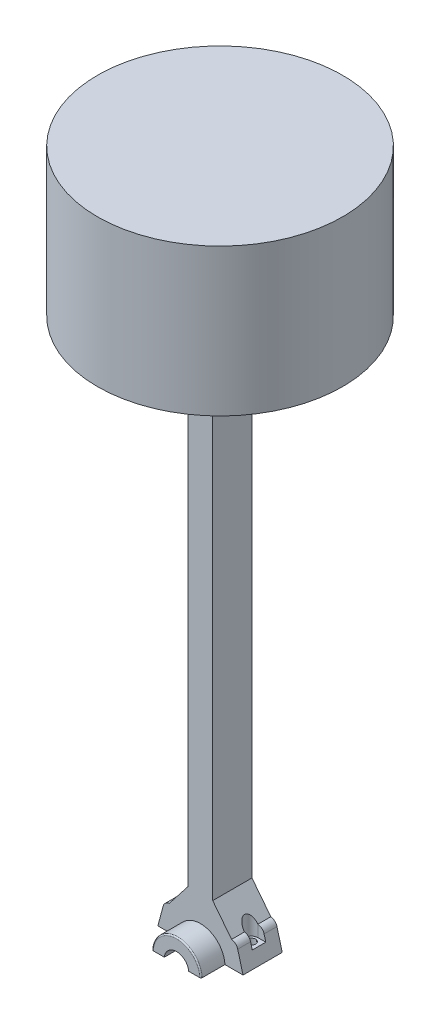
ISO-10303-21;
HEADER;
FILE_DESCRIPTION(('STEP AP214'),'2;1');
FILE_NAME('part.step','',(''),(''),'','','');
FILE_SCHEMA(('AUTOMOTIVE_DESIGN { 1 0 10303 214 1 1 1 1 }'));
ENDSEC;
DATA;
#1=APPLICATION_CONTEXT('core data for automotive mechanical design processes');
#2=APPLICATION_PROTOCOL_DEFINITION('international standard','automotive_design',2000,#1);
#3=PRODUCT_CONTEXT('',#1,'mechanical');
#4=PRODUCT('Part','Part','',(#3));
#5=PRODUCT_RELATED_PRODUCT_CATEGORY('part','',(#4));
#6=PRODUCT_DEFINITION_FORMATION('','',#4);
#7=PRODUCT_DEFINITION_CONTEXT('part definition',#1,'design');
#8=PRODUCT_DEFINITION('design','',#6,#7);
#9=PRODUCT_DEFINITION_SHAPE('','',#8);
#10=(LENGTH_UNIT() NAMED_UNIT(*) SI_UNIT(.MILLI.,.METRE.));
#11=(NAMED_UNIT(*) PLANE_ANGLE_UNIT() SI_UNIT($,.RADIAN.));
#12=(NAMED_UNIT(*) SI_UNIT($,.STERADIAN.) SOLID_ANGLE_UNIT());
#13=UNCERTAINTY_MEASURE_WITH_UNIT(LENGTH_MEASURE(1.E-05),#10,'distance_accuracy_value','');
#14=(GEOMETRIC_REPRESENTATION_CONTEXT(3) GLOBAL_UNCERTAINTY_ASSIGNED_CONTEXT((#13)) GLOBAL_UNIT_ASSIGNED_CONTEXT((#10,
#11,#12)) REPRESENTATION_CONTEXT('',''));
#15=CARTESIAN_POINT('',(0.,0.,0.));
#16=DIRECTION('',(0.,0.,1.));
#17=DIRECTION('',(1.,0.,0.));
#18=AXIS2_PLACEMENT_3D('',#15,#16,#17);
#19=CARTESIAN_POINT('',(-35.,0.,30.5));
#20=DIRECTION('',(-0.965925826289067,0.258819045102525,0.));
#21=DIRECTION('',(-0.258819045102525,-0.965925826289067,0.));
#22=AXIS2_PLACEMENT_3D('',#19,#20,#21);
#23=PLANE('',#22);
#24=DIRECTION('',(0.,0.,-1.));
#25=VECTOR('',#24,1.);
#26=CARTESIAN_POINT('',(-34.7320508075689,1.,30.5));
#27=LINE('',#26,#25);
#28=CARTESIAN_POINT('',(-34.7320508075689,1.,30.5));
#29=VERTEX_POINT('',#28);
#30=CARTESIAN_POINT('',(-34.7320508075689,1.,-1.5));
#31=VERTEX_POINT('',#30);
#32=EDGE_CURVE('E276',#29,#31,#27,.T.);
#33=ORIENTED_EDGE('',*,*,#32,.F.);
#34=DIRECTION('',(0.258819045102525,0.965925826289067,0.));
#35=VECTOR('',#34,1.);
#36=CARTESIAN_POINT('',(-35.,0.,30.5));
#37=LINE('',#36,#35);
#38=CARTESIAN_POINT('',(-30.4057040927294,17.1461457509392,30.5));
#39=VERTEX_POINT('',#38);
#40=EDGE_CURVE('E398',#29,#39,#37,.T.);
#41=ORIENTED_EDGE('',*,*,#40,.T.);
#42=DIRECTION('',(0.,0.,-1.));
#43=VECTOR('',#42,1.);
#44=CARTESIAN_POINT('',(-30.4057040927294,17.1461457509392,30.5));
#45=LINE('',#44,#43);
#46=CARTESIAN_POINT('',(-30.4057040927294,17.1461457509392,20.));
#47=VERTEX_POINT('',#46);
#48=EDGE_CURVE('E408',#39,#47,#45,.T.);
#49=ORIENTED_EDGE('',*,*,#48,.T.);
#50=DIRECTION('',(0.258819045102525,0.965925826289067,0.));
#51=VECTOR('',#50,1.);
#52=CARTESIAN_POINT('',(-28.113370667976,25.7012505600074,20.));
#53=LINE('',#52,#51);
#54=CARTESIAN_POINT('',(-31.7846096908265,12.,20.));
#55=VERTEX_POINT('',#54);
#56=EDGE_CURVE('E287',#55,#47,#53,.T.);
#57=ORIENTED_EDGE('',*,*,#56,.F.);
#58=DIRECTION('',(0.,0.,-1.));
#59=VECTOR('',#58,1.);
#60=CARTESIAN_POINT('',(-31.7846096908265,12.,14.5));
#61=LINE('',#60,#59);
#62=CARTESIAN_POINT('',(-31.7846096908265,12.,9.));
#63=VERTEX_POINT('',#62);
#64=EDGE_CURVE('E332',#55,#63,#61,.T.);
#65=ORIENTED_EDGE('',*,*,#64,.T.);
#66=DIRECTION('',(-0.258819045102525,-0.965925826289067,0.));
#67=VECTOR('',#66,1.);
#68=CARTESIAN_POINT('',(-28.113370667976,25.7012505600074,9.));
#69=LINE('',#68,#67);
#70=CARTESIAN_POINT('',(-30.4057040927294,17.1461457509392,8.99999999999999));
#71=VERTEX_POINT('',#70);
#72=EDGE_CURVE('E289',#71,#63,#69,.T.);
#73=ORIENTED_EDGE('',*,*,#72,.F.);
#74=CARTESIAN_POINT('',(-30.4057040927294,17.1461457509392,-1.5));
#75=VERTEX_POINT('',#74);
#76=EDGE_CURVE('E407',#71,#75,#45,.T.);
#77=ORIENTED_EDGE('',*,*,#76,.T.);
#78=DIRECTION('',(0.258819045102525,0.965925826289067,0.));
#79=VECTOR('',#78,1.);
#80=CARTESIAN_POINT('',(-35.,0.,-1.5));
#81=LINE('',#80,#79);
#82=EDGE_CURVE('E399',#31,#75,#81,.T.);
#83=ORIENTED_EDGE('',*,*,#82,.F.);
#84=EDGE_LOOP('',(#33,#41,#49,#57,#65,#73,#77,#83));
#85=FACE_BOUND('',#84,.T.);
#86=ADVANCED_FACE('F39',(#85),#23,.T.);
#87=CARTESIAN_POINT('',(-24.610149134995,15.5932314803241,30.5));
#88=DIRECTION('',(0.,0.,-1.));
#89=DIRECTION('',(-1.,0.,0.));
#90=AXIS2_PLACEMENT_3D('',#87,#88,#89);
#91=CYLINDRICAL_SURFACE('',#90,6.);
#92=CARTESIAN_POINT('',(-24.610149134995,15.5932314803241,9.));
#93=DIRECTION('',(0.,0.,1.));
#94=DIRECTION('',(1.,0.,0.));
#95=AXIS2_PLACEMENT_3D('',#92,#93,#94);
#96=CIRCLE('',#95,6.);
#97=CARTESIAN_POINT('',(-25.5,21.526878372249,9.));
#98=VERTEX_POINT('',#97);
#99=EDGE_CURVE('E300',#98,#71,#96,.T.);
#100=ORIENTED_EDGE('',*,*,#99,.F.);
#101=CARTESIAN_POINT('',(-25.4197517185428,21.5383592044956,9.00058546631342));
#102=CARTESIAN_POINT('',(-25.4331386603451,21.5365361855752,9.00039021776701));
#103=CARTESIAN_POINT('',(-25.4465194880343,21.5346679400944,9.00024380463436));
#104=CARTESIAN_POINT('',(-25.4732689151867,21.5308409960122,9.00004864919655));
#105=CARTESIAN_POINT('',(-25.4866375146498,21.5288822974107,8.9999999068914));
#106=CARTESIAN_POINT('',(-25.5,21.526878372249,9.));
#107=B_SPLINE_CURVE_WITH_KNOTS('',3,(#101,#102,#103,#104,#105,#106),.UNSPECIFIED.,.F.,.F.,(4,2,
4),(0.,0.0405342441482808,0.0810684882965614),.UNSPECIFIED.);
#108=CARTESIAN_POINT('',(-25.4197517185428,21.5383592044956,9.00058546631355));
#109=VERTEX_POINT('',#108);
#110=EDGE_CURVE('E314',#109,#98,#107,.T.);
#111=ORIENTED_EDGE('',*,*,#110,.F.);
#112=DIRECTION('',(0.,0.,-1.));
#113=VECTOR('',#112,1.);
#114=CARTESIAN_POINT('',(-25.4197517185428,21.5383592044956,30.5));
#115=LINE('',#114,#113);
#116=CARTESIAN_POINT('',(-25.4197517185428,21.5383592044956,-1.5));
#117=VERTEX_POINT('',#116);
#118=EDGE_CURVE('E416',#117,#109,#115,.F.);
#119=ORIENTED_EDGE('',*,*,#118,.F.);
#120=CARTESIAN_POINT('',(-24.610149134995,15.5932314803241,-1.5));
#121=DIRECTION('',(0.,0.,1.));
#122=DIRECTION('',(1.,0.,0.));
#123=AXIS2_PLACEMENT_3D('',#120,#121,#122);
#124=CIRCLE('',#123,6.);
#125=EDGE_CURVE('E413',#75,#117,#124,.F.);
#126=ORIENTED_EDGE('',*,*,#125,.F.);
#127=ORIENTED_EDGE('',*,*,#76,.F.);
#128=EDGE_LOOP('',(#100,#111,#119,#126,#127));
#129=FACE_BOUND('',#128,.T.);
#130=ADVANCED_FACE('F473',(#129),#91,.T.);
#131=CARTESIAN_POINT('',(-25.4197517185428,21.5383592044956,19.9994145336867));
#132=VERTEX_POINT('',#131);
#133=CARTESIAN_POINT('',(-25.4197517185428,21.5383592044956,30.5));
#134=VERTEX_POINT('',#133);
#135=EDGE_CURVE('E415',#132,#134,#115,.F.);
#136=ORIENTED_EDGE('',*,*,#135,.F.);
#137=CARTESIAN_POINT('',(-25.5,21.526878372249,20.));
#138=CARTESIAN_POINT('',(-25.4866375146498,21.5288822974107,20.0000000931086));
#139=CARTESIAN_POINT('',(-25.4732689151867,21.5308409960122,19.9999513508034));
#140=CARTESIAN_POINT('',(-25.4465194880343,21.5346679400944,19.9997561953656));
#141=CARTESIAN_POINT('',(-25.4331386603451,21.5365361855752,19.999609782233));
#142=CARTESIAN_POINT('',(-25.4197517185428,21.5383592044956,19.9994145336866));
#143=B_SPLINE_CURVE_WITH_KNOTS('',3,(#137,#138,#139,#140,#141,#142),.UNSPECIFIED.,.F.,.F.,(4,2,
4),(0.,0.0405342441482806,0.0810684882965614),.UNSPECIFIED.);
#144=CARTESIAN_POINT('',(-25.5,21.526878372249,20.));
#145=VERTEX_POINT('',#144);
#146=EDGE_CURVE('E291',#145,#132,#143,.T.);
#147=ORIENTED_EDGE('',*,*,#146,.F.);
#148=CARTESIAN_POINT('',(-24.610149134995,15.5932314803241,20.));
#149=DIRECTION('',(0.,0.,-1.));
#150=DIRECTION('',(-1.,0.,0.));
#151=AXIS2_PLACEMENT_3D('',#148,#149,#150);
#152=CIRCLE('',#151,6.);
#153=EDGE_CURVE('E336',#47,#145,#152,.T.);
#154=ORIENTED_EDGE('',*,*,#153,.F.);
#155=ORIENTED_EDGE('',*,*,#48,.F.);
#156=CARTESIAN_POINT('',(-24.610149134995,15.5932314803241,30.5));
#157=DIRECTION('',(0.,0.,1.));
#158=DIRECTION('',(1.,0.,0.));
#159=AXIS2_PLACEMENT_3D('',#156,#157,#158);
#160=CIRCLE('',#159,6.);
#161=EDGE_CURVE('E422',#134,#39,#160,.T.);
#162=ORIENTED_EDGE('',*,*,#161,.F.);
#163=EDGE_LOOP('',(#136,#147,#154,#155,#162));
#164=FACE_BOUND('',#163,.T.);
#165=ADVANCED_FACE('F479',(#164),#91,.T.);
#166=CARTESIAN_POINT('',(24.610149134995,15.5932314803241,30.5));
#167=DIRECTION('',(0.,0.,-1.));
#168=DIRECTION('',(-1.,0.,0.));
#169=AXIS2_PLACEMENT_3D('',#166,#167,#168);
#170=CYLINDRICAL_SURFACE('',#169,6.);
#171=CARTESIAN_POINT('',(24.610149134995,15.5932314803241,20.));
#172=DIRECTION('',(0.,0.,1.));
#173=DIRECTION('',(1.,0.,0.));
#174=AXIS2_PLACEMENT_3D('',#171,#172,#173);
#175=CIRCLE('',#174,6.);
#176=CARTESIAN_POINT('',(30.4057040927294,17.1461457509392,20.));
#177=VERTEX_POINT('',#176);
#178=CARTESIAN_POINT('',(25.5,21.526878372249,20.));
#179=VERTEX_POINT('',#178);
#180=EDGE_CURVE('E356',#177,#179,#175,.T.);
#181=ORIENTED_EDGE('',*,*,#180,.T.);
#182=CARTESIAN_POINT('',(25.5,21.526878372249,20.));
#183=CARTESIAN_POINT('',(25.4866375146499,21.5288822974107,20.0000000931086));
#184=CARTESIAN_POINT('',(25.4732689151867,21.5308409960122,19.9999513508034));
#185=CARTESIAN_POINT('',(25.4465194880343,21.5346679400944,19.9997561953656));
#186=CARTESIAN_POINT('',(25.4331386603451,21.5365361855752,19.999609782233));
#187=CARTESIAN_POINT('',(25.4197517185428,21.5383592044956,19.9994145336866));
#188=B_SPLINE_CURVE_WITH_KNOTS('',3,(#182,#183,#184,#185,#186,#187),.UNSPECIFIED.,.F.,.F.,(4,2,
4),(0.,0.0405342441482771,0.081068488296558),.UNSPECIFIED.);
#189=CARTESIAN_POINT('',(25.4197517185428,21.5383592044956,19.9994145336866));
#190=VERTEX_POINT('',#189);
#191=EDGE_CURVE('E368',#179,#190,#188,.T.);
#192=ORIENTED_EDGE('',*,*,#191,.T.);
#193=DIRECTION('',(0.,0.,-1.));
#194=VECTOR('',#193,1.);
#195=CARTESIAN_POINT('',(25.4197517185428,21.5383592044956,30.5));
#196=LINE('',#195,#194);
#197=CARTESIAN_POINT('',(25.4197517185429,21.5383592044956,30.5));
#198=VERTEX_POINT('',#197);
#199=EDGE_CURVE('E426',#198,#190,#196,.T.);
#200=ORIENTED_EDGE('',*,*,#199,.F.);
#201=CARTESIAN_POINT('',(24.610149134995,15.5932314803241,30.5));
#202=DIRECTION('',(0.,0.,1.));
#203=DIRECTION('',(1.,0.,0.));
#204=AXIS2_PLACEMENT_3D('',#201,#202,#203);
#205=CIRCLE('',#204,6.);
#206=CARTESIAN_POINT('',(30.4057040927294,17.1461457509392,30.5));
#207=VERTEX_POINT('',#206);
#208=EDGE_CURVE('E419',#207,#198,#205,.T.);
#209=ORIENTED_EDGE('',*,*,#208,.F.);
#210=DIRECTION('',(0.,0.,-1.));
#211=VECTOR('',#210,1.);
#212=CARTESIAN_POINT('',(30.4057040927294,17.1461457509392,30.5));
#213=LINE('',#212,#211);
#214=EDGE_CURVE('E429',#177,#207,#213,.F.);
#215=ORIENTED_EDGE('',*,*,#214,.F.);
#216=EDGE_LOOP('',(#181,#192,#200,#209,#215));
#217=FACE_BOUND('',#216,.T.);
#218=ADVANCED_FACE('F496',(#217),#170,.T.);
#219=CARTESIAN_POINT('',(0.,0.,50.));
#220=DIRECTION('',(0.,0.,-1.));
#221=DIRECTION('',(-1.,0.,0.));
#222=AXIS2_PLACEMENT_3D('',#219,#220,#221);
#223=CYLINDRICAL_SURFACE('',#222,20.);
#224=DIRECTION('',(0.,0.,-1.));
#225=VECTOR('',#224,1.);
#226=CARTESIAN_POINT('',(-19.9749843554382,1.,50.));
#227=LINE('',#226,#225);
#228=CARTESIAN_POINT('',(-19.9749843554382,1.,30.5));
#229=VERTEX_POINT('',#228);
#230=CARTESIAN_POINT('',(-19.9749843554382,1.,49.));
#231=VERTEX_POINT('',#230);
#232=EDGE_CURVE('E274',#229,#231,#227,.F.);
#233=ORIENTED_EDGE('',*,*,#232,.T.);
#234=CARTESIAN_POINT('',(0.,0.,49.));
#235=DIRECTION('',(0.,0.,1.));
#236=DIRECTION('',(1.,0.,0.));
#237=AXIS2_PLACEMENT_3D('',#234,#235,#236);
#238=CIRCLE('',#237,20.);
#239=CARTESIAN_POINT('',(19.9749843554382,1.,49.));
#240=VERTEX_POINT('',#239);
#241=EDGE_CURVE('E11',#231,#240,#238,.F.);
#242=ORIENTED_EDGE('',*,*,#241,.T.);
#243=DIRECTION('',(0.,0.,-1.));
#244=VECTOR('',#243,1.);
#245=CARTESIAN_POINT('',(19.9749843554382,1.,50.));
#246=LINE('',#245,#244);
#247=CARTESIAN_POINT('',(19.9749843554382,1.,30.5));
#248=VERTEX_POINT('',#247);
#249=EDGE_CURVE('E271',#240,#248,#246,.T.);
#250=ORIENTED_EDGE('',*,*,#249,.T.);
#251=CARTESIAN_POINT('',(0.,0.,30.5));
#252=DIRECTION('',(0.,0.,1.));
#253=DIRECTION('',(1.,0.,0.));
#254=AXIS2_PLACEMENT_3D('',#251,#252,#253);
#255=CIRCLE('',#254,20.);
#256=EDGE_CURVE('E401',#248,#229,#255,.T.);
#257=ORIENTED_EDGE('',*,*,#256,.T.);
#258=EDGE_LOOP('',(#233,#242,#250,#257));
#259=FACE_BOUND('',#258,.T.);
#260=ADVANCED_FACE('F493',(#259),#223,.T.);
#261=CARTESIAN_POINT('',(0.,0.,50.));
#262=DIRECTION('',(0.,0.,1.));
#263=DIRECTION('',(1.,0.,0.));
#264=AXIS2_PLACEMENT_3D('',#261,#262,#263);
#265=PLANE('',#264);
#266=DIRECTION('',(-1.,0.,0.));
#267=VECTOR('',#266,1.);
#268=CARTESIAN_POINT('',(-36.,1.,50.));
#269=LINE('',#268,#267);
#270=CARTESIAN_POINT('',(18.9736659610103,1.,50.));
#271=VERTEX_POINT('',#270);
#272=CARTESIAN_POINT('',(9.9498743710662,1.,50.));
#273=VERTEX_POINT('',#272);
#274=EDGE_CURVE('E257',#271,#273,#269,.T.);
#275=ORIENTED_EDGE('',*,*,#274,.F.);
#276=CARTESIAN_POINT('',(0.,0.,50.));
#277=DIRECTION('',(0.,0.,1.));
#278=DIRECTION('',(1.,0.,0.));
#279=AXIS2_PLACEMENT_3D('',#276,#277,#278);
#280=CIRCLE('',#279,19.);
#281=CARTESIAN_POINT('',(-18.9736659610103,1.,50.));
#282=VERTEX_POINT('',#281);
#283=EDGE_CURVE('E443',#271,#282,#280,.T.);
#284=ORIENTED_EDGE('',*,*,#283,.T.);
#285=CARTESIAN_POINT('',(-9.9498743710662,1.,50.));
#286=VERTEX_POINT('',#285);
#287=EDGE_CURVE('E238',#286,#282,#269,.T.);
#288=ORIENTED_EDGE('',*,*,#287,.F.);
#289=CARTESIAN_POINT('',(0.,0.,50.));
#290=DIRECTION('',(0.,0.,1.));
#291=DIRECTION('',(1.,0.,0.));
#292=AXIS2_PLACEMENT_3D('',#289,#290,#291);
#293=CIRCLE('',#292,10.);
#294=EDGE_CURVE('E278',#273,#286,#293,.T.);
#295=ORIENTED_EDGE('',*,*,#294,.F.);
#296=EDGE_LOOP('',(#275,#284,#288,#295));
#297=FACE_BOUND('',#296,.T.);
#298=ADVANCED_FACE('F490',(#297),#265,.T.);
#299=CARTESIAN_POINT('',(27.304937598009,28.718363851643,30.5));
#300=DIRECTION('',(0.,0.,1.));
#301=DIRECTION('',(1.,0.,0.));
#302=AXIS2_PLACEMENT_3D('',#299,#300,#301);
#303=PLANE('',#302);
#304=ORIENTED_EDGE('',*,*,#208,.T.);
#305=DIRECTION('',(0.615661475325659,-0.788010753606721,0.));
#306=VECTOR('',#305,1.);
#307=CARTESIAN_POINT('',(25.4197517185429,21.5383592044956,30.5));
#308=LINE('',#307,#306);
#309=CARTESIAN_POINT('',(10.0282148354014,41.2386280446636,30.5));
#310=VERTEX_POINT('',#309);
#311=EDGE_CURVE('E236',#310,#198,#308,.T.);
#312=ORIENTED_EDGE('',*,*,#311,.F.);
#313=DIRECTION('',(0.,-1.,0.));
#314=VECTOR('',#313,1.);
#315=CARTESIAN_POINT('',(10.0282148354014,41.2386280446636,30.5));
#316=LINE('',#315,#314);
#317=CARTESIAN_POINT('',(10.0282148354014,441.238628044664,30.5));
#318=VERTEX_POINT('',#317);
#319=EDGE_CURVE('E240',#318,#310,#316,.T.);
#320=ORIENTED_EDGE('',*,*,#319,.F.);
#321=DIRECTION('',(1.,0.,0.));
#322=VECTOR('',#321,1.);
#323=CARTESIAN_POINT('',(10.0282148354014,441.238628044664,30.5));
#324=LINE('',#323,#322);
#325=CARTESIAN_POINT('',(-10.0282148354013,441.238628044664,30.5));
#326=VERTEX_POINT('',#325);
#327=EDGE_CURVE('E225',#326,#318,#324,.T.);
#328=ORIENTED_EDGE('',*,*,#327,.F.);
#329=DIRECTION('',(0.,1.,0.));
#330=VECTOR('',#329,1.);
#331=CARTESIAN_POINT('',(-10.0282148354014,41.2386280446636,30.5));
#332=LINE('',#331,#330);
#333=CARTESIAN_POINT('',(-10.0282148354014,41.2386280446636,30.5));
#334=VERTEX_POINT('',#333);
#335=EDGE_CURVE('E224',#334,#326,#332,.T.);
#336=ORIENTED_EDGE('',*,*,#335,.F.);
#337=DIRECTION('',(0.61566147532566,0.788010753606721,0.));
#338=VECTOR('',#337,1.);
#339=CARTESIAN_POINT('',(-25.4197517185428,21.5383592044956,30.5));
#340=LINE('',#339,#338);
#341=EDGE_CURVE('E246',#134,#334,#340,.T.);
#342=ORIENTED_EDGE('',*,*,#341,.F.);
#343=ORIENTED_EDGE('',*,*,#161,.T.);
#344=ORIENTED_EDGE('',*,*,#40,.F.);
#345=DIRECTION('',(-1.,0.,0.));
#346=VECTOR('',#345,1.);
#347=CARTESIAN_POINT('',(27.304937598009,1.,30.5));
#348=LINE('',#347,#346);
#349=EDGE_CURVE('E272',#229,#29,#348,.T.);
#350=ORIENTED_EDGE('',*,*,#349,.F.);
#351=ORIENTED_EDGE('',*,*,#256,.F.);
#352=CARTESIAN_POINT('',(34.7320508075689,1.,30.5));
#353=VERTEX_POINT('',#352);
#354=EDGE_CURVE('E268',#353,#248,#348,.T.);
#355=ORIENTED_EDGE('',*,*,#354,.F.);
#356=DIRECTION('',(0.258819045102525,-0.965925826289067,0.));
#357=VECTOR('',#356,1.);
#358=CARTESIAN_POINT('',(29.3730669589463,21.,30.5));
#359=LINE('',#358,#357);
#360=EDGE_CURVE('E395',#207,#353,#359,.T.);
#361=ORIENTED_EDGE('',*,*,#360,.F.);
#362=EDGE_LOOP('',(#304,#312,#320,#328,#336,#342,#343,#344,#350,#351,#355,#361));
#363=FACE_BOUND('',#362,.T.);
#364=ADVANCED_FACE('F488',(#363),#303,.T.);
#365=CARTESIAN_POINT('',(29.3730669589463,21.,30.5));
#366=DIRECTION('',(0.965925826289067,0.258819045102525,0.));
#367=DIRECTION('',(-0.258819045102525,0.965925826289067,0.));
#368=AXIS2_PLACEMENT_3D('',#365,#366,#367);
#369=PLANE('',#368);
#370=DIRECTION('',(0.,0.,1.));
#371=VECTOR('',#370,1.);
#372=CARTESIAN_POINT('',(34.7320508075689,1.,30.5));
#373=LINE('',#372,#371);
#374=CARTESIAN_POINT('',(34.7320508075689,1.,-1.5));
#375=VERTEX_POINT('',#374);
#376=EDGE_CURVE('E266',#375,#353,#373,.T.);
#377=ORIENTED_EDGE('',*,*,#376,.F.);
#378=DIRECTION('',(0.258819045102525,-0.965925826289067,0.));
#379=VECTOR('',#378,1.);
#380=CARTESIAN_POINT('',(29.3730669589463,21.,-1.5));
#381=LINE('',#380,#379);
#382=CARTESIAN_POINT('',(30.4057040927294,17.1461457509392,-1.5));
#383=VERTEX_POINT('',#382);
#384=EDGE_CURVE('E394',#383,#375,#381,.T.);
#385=ORIENTED_EDGE('',*,*,#384,.F.);
#386=CARTESIAN_POINT('',(30.4057040927294,17.1461457509392,8.99999999999999));
#387=VERTEX_POINT('',#386);
#388=EDGE_CURVE('E430',#383,#387,#213,.F.);
#389=ORIENTED_EDGE('',*,*,#388,.T.);
#390=DIRECTION('',(0.258819045102525,-0.965925826289067,0.));
#391=VECTOR('',#390,1.);
#392=CARTESIAN_POINT('',(28.113370667976,25.7012505600074,9.));
#393=LINE('',#392,#391);
#394=CARTESIAN_POINT('',(31.7846096908265,12.,9.));
#395=VERTEX_POINT('',#394);
#396=EDGE_CURVE('E341',#387,#395,#393,.T.);
#397=ORIENTED_EDGE('',*,*,#396,.T.);
#398=DIRECTION('',(0.,0.,1.));
#399=VECTOR('',#398,1.);
#400=CARTESIAN_POINT('',(31.7846096908265,12.,14.5));
#401=LINE('',#400,#399);
#402=CARTESIAN_POINT('',(31.7846096908265,12.,20.));
#403=VERTEX_POINT('',#402);
#404=EDGE_CURVE('E387',#395,#403,#401,.T.);
#405=ORIENTED_EDGE('',*,*,#404,.T.);
#406=DIRECTION('',(-0.258819045102525,0.965925826289067,0.));
#407=VECTOR('',#406,1.);
#408=CARTESIAN_POINT('',(28.113370667976,25.7012505600074,20.));
#409=LINE('',#408,#407);
#410=EDGE_CURVE('E344',#403,#177,#409,.T.);
#411=ORIENTED_EDGE('',*,*,#410,.T.);
#412=ORIENTED_EDGE('',*,*,#214,.T.);
#413=ORIENTED_EDGE('',*,*,#360,.T.);
#414=EDGE_LOOP('',(#377,#385,#389,#397,#405,#411,#412,#413));
#415=FACE_BOUND('',#414,.T.);
#416=ADVANCED_FACE('F485',(#415),#369,.T.);
#417=CARTESIAN_POINT('',(27.304937598009,28.718363851643,-1.5));
#418=DIRECTION('',(0.,0.,1.));
#419=DIRECTION('',(1.,0.,0.));
#420=AXIS2_PLACEMENT_3D('',#417,#418,#419);
#421=PLANE('',#420);
#422=DIRECTION('',(0.615661475325659,-0.788010753606721,0.));
#423=VECTOR('',#422,1.);
#424=CARTESIAN_POINT('',(25.4197517185429,21.5383592044956,-1.5));
#425=LINE('',#424,#423);
#426=CARTESIAN_POINT('',(10.0282148354014,41.2386280446636,-1.5));
#427=VERTEX_POINT('',#426);
#428=CARTESIAN_POINT('',(25.4197517185429,21.5383592044956,-1.5));
#429=VERTEX_POINT('',#428);
#430=EDGE_CURVE('E249',#427,#429,#425,.T.);
#431=ORIENTED_EDGE('',*,*,#430,.T.);
#432=CARTESIAN_POINT('',(24.610149134995,15.5932314803241,-1.5));
#433=DIRECTION('',(0.,0.,1.));
#434=DIRECTION('',(1.,0.,0.));
#435=AXIS2_PLACEMENT_3D('',#432,#433,#434);
#436=CIRCLE('',#435,6.);
#437=EDGE_CURVE('E411',#429,#383,#436,.F.);
#438=ORIENTED_EDGE('',*,*,#437,.T.);
#439=ORIENTED_EDGE('',*,*,#384,.T.);
#440=DIRECTION('',(-1.,0.,0.));
#441=VECTOR('',#440,1.);
#442=CARTESIAN_POINT('',(-36.,1.,-1.5));
#443=LINE('',#442,#441);
#444=EDGE_CURVE('E253',#375,#31,#443,.T.);
#445=ORIENTED_EDGE('',*,*,#444,.T.);
#446=ORIENTED_EDGE('',*,*,#82,.T.);
#447=ORIENTED_EDGE('',*,*,#125,.T.);
#448=DIRECTION('',(0.615661475325659,0.788010753606721,0.));
#449=VECTOR('',#448,1.);
#450=CARTESIAN_POINT('',(-25.4197517185428,21.5383592044956,-1.5));
#451=LINE('',#450,#449);
#452=CARTESIAN_POINT('',(-10.0282148354014,41.2386280446636,-1.5));
#453=VERTEX_POINT('',#452);
#454=EDGE_CURVE('E230',#117,#453,#451,.T.);
#455=ORIENTED_EDGE('',*,*,#454,.T.);
#456=DIRECTION('',(0.,1.,0.));
#457=VECTOR('',#456,1.);
#458=CARTESIAN_POINT('',(-10.0282148354014,41.2386280446636,-1.5));
#459=LINE('',#458,#457);
#460=CARTESIAN_POINT('',(-10.0282148354013,441.238628044664,-1.5));
#461=VERTEX_POINT('',#460);
#462=EDGE_CURVE('E216',#453,#461,#459,.T.);
#463=ORIENTED_EDGE('',*,*,#462,.T.);
#464=DIRECTION('',(1.,0.,0.));
#465=VECTOR('',#464,1.);
#466=CARTESIAN_POINT('',(10.0282148354014,441.238628044664,-1.5));
#467=LINE('',#466,#465);
#468=CARTESIAN_POINT('',(10.0282148354014,441.238628044664,-1.5));
#469=VERTEX_POINT('',#468);
#470=EDGE_CURVE('E203',#461,#469,#467,.T.);
#471=ORIENTED_EDGE('',*,*,#470,.T.);
#472=DIRECTION('',(0.,-1.,0.));
#473=VECTOR('',#472,1.);
#474=CARTESIAN_POINT('',(10.0282148354014,41.2386280446636,-1.5));
#475=LINE('',#474,#473);
#476=EDGE_CURVE('E215',#469,#427,#475,.T.);
#477=ORIENTED_EDGE('',*,*,#476,.T.);
#478=EDGE_LOOP('',(#431,#438,#439,#445,#446,#447,#455,#463,#471,#477));
#479=FACE_BOUND('',#478,.T.);
#480=ADVANCED_FACE('F228',(#479),#421,.F.);
#481=CARTESIAN_POINT('',(24.610149134995,15.5932314803241,9.));
#482=DIRECTION('',(0.,0.,-1.));
#483=DIRECTION('',(-1.,0.,0.));
#484=AXIS2_PLACEMENT_3D('',#481,#482,#483);
#485=CIRCLE('',#484,6.);
#486=CARTESIAN_POINT('',(25.5,21.526878372249,9.));
#487=VERTEX_POINT('',#486);
#488=EDGE_CURVE('E391',#487,#387,#485,.T.);
#489=ORIENTED_EDGE('',*,*,#488,.T.);
#490=ORIENTED_EDGE('',*,*,#388,.F.);
#491=ORIENTED_EDGE('',*,*,#437,.F.);
#492=CARTESIAN_POINT('',(25.4197517185429,21.5383592044956,9.00058546631344));
#493=VERTEX_POINT('',#492);
#494=EDGE_CURVE('E425',#493,#429,#196,.T.);
#495=ORIENTED_EDGE('',*,*,#494,.F.);
#496=CARTESIAN_POINT('',(25.4197517185428,21.5383592044956,9.00058546631342));
#497=CARTESIAN_POINT('',(25.4331386603451,21.5365361855752,9.00039021776701));
#498=CARTESIAN_POINT('',(25.4465194880343,21.5346679400944,9.00024380463436));
#499=CARTESIAN_POINT('',(25.4732689151867,21.5308409960122,9.00004864919655));
#500=CARTESIAN_POINT('',(25.4866375146499,21.5288822974108,8.9999999068914));
#501=CARTESIAN_POINT('',(25.5,21.526878372249,9.));
#502=B_SPLINE_CURVE_WITH_KNOTS('',3,(#496,#497,#498,#499,#500,#501),.UNSPECIFIED.,.F.,.F.,(4,2,
4),(0.,0.0405342441482808,0.0810684882965574),.UNSPECIFIED.);
#503=EDGE_CURVE('E347',#493,#487,#502,.T.);
#504=ORIENTED_EDGE('',*,*,#503,.T.);
#505=EDGE_LOOP('',(#489,#490,#491,#495,#504));
#506=FACE_BOUND('',#505,.T.);
#507=ADVANCED_FACE('F497',(#506),#170,.T.);
#508=CARTESIAN_POINT('',(25.5,25.001,20.));
#509=DIRECTION('',(0.,0.,1.));
#510=DIRECTION('',(1.,0.,0.));
#511=AXIS2_PLACEMENT_3D('',#508,#509,#510);
#512=PLANE('',#511);
#513=DIRECTION('',(-1.,0.,0.));
#514=VECTOR('',#513,1.);
#515=CARTESIAN_POINT('',(25.5,12.,20.));
#516=LINE('',#515,#514);
#517=CARTESIAN_POINT('',(25.5,12.,20.));
#518=VERTEX_POINT('',#517);
#519=EDGE_CURVE('E381',#403,#518,#516,.T.);
#520=ORIENTED_EDGE('',*,*,#519,.T.);
#521=DIRECTION('',(0.,-1.,0.));
#522=VECTOR('',#521,1.);
#523=CARTESIAN_POINT('',(25.5,25.001,20.));
#524=LINE('',#523,#522);
#525=EDGE_CURVE('E385',#179,#518,#524,.T.);
#526=ORIENTED_EDGE('',*,*,#525,.F.);
#527=ORIENTED_EDGE('',*,*,#180,.F.);
#528=ORIENTED_EDGE('',*,*,#410,.F.);
#529=EDGE_LOOP('',(#520,#526,#527,#528));
#530=FACE_BOUND('',#529,.T.);
#531=ADVANCED_FACE('F499',(#530),#512,.F.);
#532=CARTESIAN_POINT('',(25.5,25.001,9.));
#533=DIRECTION('',(0.,0.,-1.));
#534=DIRECTION('',(-1.,0.,0.));
#535=AXIS2_PLACEMENT_3D('',#532,#533,#534);
#536=PLANE('',#535);
#537=ORIENTED_EDGE('',*,*,#488,.F.);
#538=DIRECTION('',(0.,-1.,0.));
#539=VECTOR('',#538,1.);
#540=CARTESIAN_POINT('',(25.5,25.001,9.));
#541=LINE('',#540,#539);
#542=CARTESIAN_POINT('',(25.5,12.,9.));
#543=VERTEX_POINT('',#542);
#544=EDGE_CURVE('E384',#487,#543,#541,.T.);
#545=ORIENTED_EDGE('',*,*,#544,.T.);
#546=DIRECTION('',(1.,0.,0.));
#547=VECTOR('',#546,1.);
#548=CARTESIAN_POINT('',(25.5,12.,9.));
#549=LINE('',#548,#547);
#550=EDGE_CURVE('E378',#543,#395,#549,.T.);
#551=ORIENTED_EDGE('',*,*,#550,.T.);
#552=ORIENTED_EDGE('',*,*,#396,.F.);
#553=EDGE_LOOP('',(#537,#545,#551,#552));
#554=FACE_BOUND('',#553,.T.);
#555=ADVANCED_FACE('F505',(#554),#536,.F.);
#556=CARTESIAN_POINT('',(25.5,25.001,14.5));
#557=DIRECTION('',(0.,-1.,0.));
#558=DIRECTION('',(0.,0.,-1.));
#559=AXIS2_PLACEMENT_3D('',#556,#557,#558);
#560=CYLINDRICAL_SURFACE('',#559,5.5);
#561=ORIENTED_EDGE('',*,*,#525,.T.);
#562=CARTESIAN_POINT('',(25.5,12.,14.5));
#563=DIRECTION('',(0.,-1.,0.));
#564=DIRECTION('',(0.,0.,-1.));
#565=AXIS2_PLACEMENT_3D('',#562,#563,#564);
#566=CIRCLE('',#565,5.5);
#567=EDGE_CURVE('E375',#518,#543,#566,.T.);
#568=ORIENTED_EDGE('',*,*,#567,.T.);
#569=ORIENTED_EDGE('',*,*,#544,.F.);
#570=ORIENTED_EDGE('',*,*,#503,.F.);
#571=CARTESIAN_POINT('',(25.5,21.4356460881466,14.5));
#572=DIRECTION('',(0.788010753606721,0.615661475325659,0.));
#573=DIRECTION('',(0.615661475325659,-0.788010753606721,0.));
#574=AXIS2_PLACEMENT_3D('',#571,#572,#573);
#575=ELLIPSE('',#574,8.93348085015508,5.5);
#576=EDGE_CURVE('E439',#190,#493,#575,.F.);
#577=ORIENTED_EDGE('',*,*,#576,.F.);
#578=ORIENTED_EDGE('',*,*,#191,.F.);
#579=EDGE_LOOP('',(#561,#568,#569,#570,#577,#578));
#580=FACE_BOUND('',#579,.T.);
#581=ADVANCED_FACE('F358',(#580),#560,.F.);
#582=CARTESIAN_POINT('',(25.5,12.,14.5));
#583=DIRECTION('',(0.,-1.,0.));
#584=DIRECTION('',(0.,0.,-1.));
#585=AXIS2_PLACEMENT_3D('',#582,#583,#584);
#586=PLANE('',#585);
#587=CARTESIAN_POINT('',(25.5,12.,14.5));
#588=DIRECTION('',(0.,1.,0.));
#589=DIRECTION('',(0.,0.,1.));
#590=AXIS2_PLACEMENT_3D('',#587,#588,#589);
#591=CIRCLE('',#590,3.5);
#592=CARTESIAN_POINT('',(25.5,12.,18.));
#593=VERTEX_POINT('',#592);
#594=EDGE_CURVE('E338',#593,#593,#591,.T.);
#595=ORIENTED_EDGE('',*,*,#594,.F.);
#596=EDGE_LOOP('',(#595));
#597=FACE_BOUND('',#596,.T.);
#598=ORIENTED_EDGE('',*,*,#550,.F.);
#599=ORIENTED_EDGE('',*,*,#567,.F.);
#600=ORIENTED_EDGE('',*,*,#519,.F.);
#601=ORIENTED_EDGE('',*,*,#404,.F.);
#602=EDGE_LOOP('',(#598,#599,#600,#601));
#603=FACE_BOUND('',#602,.T.);
#604=ADVANCED_FACE('F365',(#597,#603),#586,.F.);
#605=CARTESIAN_POINT('',(25.5,0.,14.5));
#606=DIRECTION('',(0.,1.,0.));
#607=DIRECTION('',(0.,0.,1.));
#608=AXIS2_PLACEMENT_3D('',#605,#606,#607);
#609=CYLINDRICAL_SURFACE('',#608,3.5);
#610=CARTESIAN_POINT('',(25.5,1.,14.5));
#611=DIRECTION('',(0.,1.,0.));
#612=DIRECTION('',(0.,0.,1.));
#613=AXIS2_PLACEMENT_3D('',#610,#611,#612);
#614=CIRCLE('',#613,3.5);
#615=CARTESIAN_POINT('',(25.5,1.,18.));
#616=VERTEX_POINT('',#615);
#617=EDGE_CURVE('E263',#616,#616,#614,.F.);
#618=ORIENTED_EDGE('',*,*,#617,.T.);
#619=EDGE_LOOP('',(#618));
#620=FACE_BOUND('',#619,.T.);
#621=ORIENTED_EDGE('',*,*,#594,.T.);
#622=EDGE_LOOP('',(#621));
#623=FACE_BOUND('',#622,.T.);
#624=ADVANCED_FACE('F364',(#620,#623),#609,.F.);
#625=CARTESIAN_POINT('',(-25.5,25.001,14.5));
#626=DIRECTION('',(0.,-1.,0.));
#627=DIRECTION('',(0.,0.,-1.));
#628=AXIS2_PLACEMENT_3D('',#625,#626,#627);
#629=CYLINDRICAL_SURFACE('',#628,5.5);
#630=ORIENTED_EDGE('',*,*,#146,.T.);
#631=CARTESIAN_POINT('',(-25.5,21.4356460881466,14.5));
#632=DIRECTION('',(-0.788010753606721,0.61566147532566,0.));
#633=DIRECTION('',(-0.61566147532566,-0.788010753606721,0.));
#634=AXIS2_PLACEMENT_3D('',#631,#632,#633);
#635=ELLIPSE('',#634,8.93348085015507,5.5);
#636=EDGE_CURVE('E441',#109,#132,#635,.F.);
#637=ORIENTED_EDGE('',*,*,#636,.F.);
#638=ORIENTED_EDGE('',*,*,#110,.T.);
#639=DIRECTION('',(0.,-1.,0.));
#640=VECTOR('',#639,1.);
#641=CARTESIAN_POINT('',(-25.5,25.001,9.));
#642=LINE('',#641,#640);
#643=CARTESIAN_POINT('',(-25.5,12.,9.));
#644=VERTEX_POINT('',#643);
#645=EDGE_CURVE('E330',#98,#644,#642,.T.);
#646=ORIENTED_EDGE('',*,*,#645,.T.);
#647=CARTESIAN_POINT('',(-25.5,12.,14.5));
#648=DIRECTION('',(0.,1.,0.));
#649=DIRECTION('',(0.,0.,-1.));
#650=AXIS2_PLACEMENT_3D('',#647,#648,#649);
#651=CIRCLE('',#650,5.5);
#652=CARTESIAN_POINT('',(-25.5,12.,20.));
#653=VERTEX_POINT('',#652);
#654=EDGE_CURVE('E320',#653,#644,#651,.T.);
#655=ORIENTED_EDGE('',*,*,#654,.F.);
#656=DIRECTION('',(0.,-1.,0.));
#657=VECTOR('',#656,1.);
#658=CARTESIAN_POINT('',(-25.5,25.001,20.));
#659=LINE('',#658,#657);
#660=EDGE_CURVE('E329',#145,#653,#659,.T.);
#661=ORIENTED_EDGE('',*,*,#660,.F.);
#662=EDGE_LOOP('',(#630,#637,#638,#646,#655,#661));
#663=FACE_BOUND('',#662,.T.);
#664=ADVANCED_FACE('F302',(#663),#629,.F.);
#665=CARTESIAN_POINT('',(-25.5,25.001,9.));
#666=DIRECTION('',(0.,0.,1.));
#667=DIRECTION('',(1.,0.,0.));
#668=AXIS2_PLACEMENT_3D('',#665,#666,#667);
#669=PLANE('',#668);
#670=ORIENTED_EDGE('',*,*,#72,.T.);
#671=DIRECTION('',(-1.,0.,0.));
#672=VECTOR('',#671,1.);
#673=CARTESIAN_POINT('',(-25.5,12.,9.));
#674=LINE('',#673,#672);
#675=EDGE_CURVE('E326',#644,#63,#674,.T.);
#676=ORIENTED_EDGE('',*,*,#675,.F.);
#677=ORIENTED_EDGE('',*,*,#645,.F.);
#678=ORIENTED_EDGE('',*,*,#99,.T.);
#679=EDGE_LOOP('',(#670,#676,#677,#678));
#680=FACE_BOUND('',#679,.T.);
#681=ADVANCED_FACE('F586',(#680),#669,.T.);
#682=CARTESIAN_POINT('',(-25.5,25.001,20.));
#683=DIRECTION('',(0.,0.,-1.));
#684=DIRECTION('',(-1.,0.,0.));
#685=AXIS2_PLACEMENT_3D('',#682,#683,#684);
#686=PLANE('',#685);
#687=ORIENTED_EDGE('',*,*,#56,.T.);
#688=ORIENTED_EDGE('',*,*,#153,.T.);
#689=ORIENTED_EDGE('',*,*,#660,.T.);
#690=DIRECTION('',(1.,0.,0.));
#691=VECTOR('',#690,1.);
#692=CARTESIAN_POINT('',(-25.5,12.,20.));
#693=LINE('',#692,#691);
#694=EDGE_CURVE('E323',#55,#653,#693,.T.);
#695=ORIENTED_EDGE('',*,*,#694,.F.);
#696=EDGE_LOOP('',(#687,#688,#689,#695));
#697=FACE_BOUND('',#696,.T.);
#698=ADVANCED_FACE('F718',(#697),#686,.T.);
#699=CARTESIAN_POINT('',(-25.5,12.,14.5));
#700=DIRECTION('',(0.,-1.,0.));
#701=DIRECTION('',(0.,0.,-1.));
#702=AXIS2_PLACEMENT_3D('',#699,#700,#701);
#703=PLANE('',#702);
#704=CARTESIAN_POINT('',(-25.5,12.,14.5));
#705=DIRECTION('',(0.,-1.,0.));
#706=DIRECTION('',(0.,0.,1.));
#707=AXIS2_PLACEMENT_3D('',#704,#705,#706);
#708=CIRCLE('',#707,3.5);
#709=CARTESIAN_POINT('',(-25.5,12.,18.));
#710=VERTEX_POINT('',#709);
#711=EDGE_CURVE('E282',#710,#710,#708,.T.);
#712=ORIENTED_EDGE('',*,*,#711,.T.);
#713=EDGE_LOOP('',(#712));
#714=FACE_BOUND('',#713,.T.);
#715=ORIENTED_EDGE('',*,*,#694,.T.);
#716=ORIENTED_EDGE('',*,*,#654,.T.);
#717=ORIENTED_EDGE('',*,*,#675,.T.);
#718=ORIENTED_EDGE('',*,*,#64,.F.);
#719=EDGE_LOOP('',(#715,#716,#717,#718));
#720=FACE_BOUND('',#719,.T.);
#721=ADVANCED_FACE('F311',(#714,#720),#703,.F.);
#722=CARTESIAN_POINT('',(-25.5,0.,14.5));
#723=DIRECTION('',(0.,1.,0.));
#724=DIRECTION('',(0.,0.,1.));
#725=AXIS2_PLACEMENT_3D('',#722,#723,#724);
#726=CYLINDRICAL_SURFACE('',#725,3.5);
#727=CARTESIAN_POINT('',(-25.5,1.,14.5));
#728=DIRECTION('',(0.,1.,0.));
#729=DIRECTION('',(0.,0.,1.));
#730=AXIS2_PLACEMENT_3D('',#727,#728,#729);
#731=CIRCLE('',#730,3.5);
#732=CARTESIAN_POINT('',(-25.5,1.,18.));
#733=VERTEX_POINT('',#732);
#734=EDGE_CURVE('E260',#733,#733,#731,.T.);
#735=ORIENTED_EDGE('',*,*,#734,.F.);
#736=EDGE_LOOP('',(#735));
#737=FACE_BOUND('',#736,.T.);
#738=ORIENTED_EDGE('',*,*,#711,.F.);
#739=EDGE_LOOP('',(#738));
#740=FACE_BOUND('',#739,.T.);
#741=ADVANCED_FACE('F309',(#737,#740),#726,.F.);
#742=CARTESIAN_POINT('',(0.,0.,1.));
#743=DIRECTION('',(0.,0.,1.));
#744=DIRECTION('',(1.,0.,0.));
#745=AXIS2_PLACEMENT_3D('',#742,#743,#744);
#746=PLANE('',#745);
#747=DIRECTION('',(-1.,0.,0.));
#748=VECTOR('',#747,1.);
#749=CARTESIAN_POINT('',(0.,1.,1.));
#750=LINE('',#749,#748);
#751=CARTESIAN_POINT('',(9.9498743710662,1.,1.));
#752=VERTEX_POINT('',#751);
#753=CARTESIAN_POINT('',(-9.9498743710662,1.,1.));
#754=VERTEX_POINT('',#753);
#755=EDGE_CURVE('E256',#752,#754,#750,.T.);
#756=ORIENTED_EDGE('',*,*,#755,.F.);
#757=CARTESIAN_POINT('',(0.,0.,1.));
#758=DIRECTION('',(0.,0.,1.));
#759=DIRECTION('',(1.,0.,0.));
#760=AXIS2_PLACEMENT_3D('',#757,#758,#759);
#761=CIRCLE('',#760,10.);
#762=EDGE_CURVE('E279',#752,#754,#761,.T.);
#763=ORIENTED_EDGE('',*,*,#762,.T.);
#764=EDGE_LOOP('',(#756,#763));
#765=FACE_BOUND('',#764,.T.);
#766=ADVANCED_FACE('F464',(#765),#746,.T.);
#767=CARTESIAN_POINT('',(0.,0.,1.));
#768=DIRECTION('',(0.,0.,1.));
#769=DIRECTION('',(1.,0.,0.));
#770=AXIS2_PLACEMENT_3D('',#767,#768,#769);
#771=CYLINDRICAL_SURFACE('',#770,10.);
#772=ORIENTED_EDGE('',*,*,#294,.T.);
#773=DIRECTION('',(0.,0.,1.));
#774=VECTOR('',#773,1.);
#775=CARTESIAN_POINT('',(-9.9498743710662,1.,1.));
#776=LINE('',#775,#774);
#777=EDGE_CURVE('E436',#286,#754,#776,.F.);
#778=ORIENTED_EDGE('',*,*,#777,.T.);
#779=ORIENTED_EDGE('',*,*,#762,.F.);
#780=DIRECTION('',(0.,0.,1.));
#781=VECTOR('',#780,1.);
#782=CARTESIAN_POINT('',(9.9498743710662,1.,1.));
#783=LINE('',#782,#781);
#784=EDGE_CURVE('E433',#752,#273,#783,.T.);
#785=ORIENTED_EDGE('',*,*,#784,.T.);
#786=EDGE_LOOP('',(#772,#778,#779,#785));
#787=FACE_BOUND('',#786,.T.);
#788=ADVANCED_FACE('F462',(#787),#771,.F.);
#789=CARTESIAN_POINT('',(-36.,1.,-1.5));
#790=DIRECTION('',(0.,1.,0.));
#791=DIRECTION('',(0.,0.,1.));
#792=AXIS2_PLACEMENT_3D('',#789,#790,#791);
#793=PLANE('',#792);
#794=ORIENTED_EDGE('',*,*,#287,.T.);
#795=CARTESIAN_POINT('',(-18.9736659610103,1.,50.));
#796=CARTESIAN_POINT('',(-19.0018656485731,1.,49.9999997919581));
#797=CARTESIAN_POINT('',(-19.0300518428308,1.,49.9988097256769));
#798=CARTESIAN_POINT('',(-19.0862227936006,1.,49.9940618387812));
#799=CARTESIAN_POINT('',(-19.1142075590453,1.,49.9905041238257));
#800=CARTESIAN_POINT('',(-19.1975124251697,1.,49.9763125205456));
#801=CARTESIAN_POINT('',(-19.2522749138993,1.,49.9621600843432));
#802=CARTESIAN_POINT('',(-19.3586456386793,1.,49.9248611219113));
#803=CARTESIAN_POINT('',(-19.4102522943237,1.,49.9017101313104));
#804=CARTESIAN_POINT('',(-19.5088408553187,1.,49.8470696783987));
#805=CARTESIAN_POINT('',(-19.5558236304112,1.,49.8155817883685));
#806=CARTESIAN_POINT('',(-19.6437962024706,1.,49.7451810675812));
#807=CARTESIAN_POINT('',(-19.68479001898,1.,49.7062732575766));
#808=CARTESIAN_POINT('',(-19.7596625952921,1.,49.6221104902999));
#809=CARTESIAN_POINT('',(-19.7935399771566,1.,49.5768543066314));
#810=CARTESIAN_POINT('',(-19.8531666127071,1.,49.4813438796463));
#811=CARTESIAN_POINT('',(-19.8789244289269,1.,49.431094975501));
#812=CARTESIAN_POINT('',(-19.921614051608,1.,49.3269928457502));
#813=CARTESIAN_POINT('',(-19.9385511871793,1.,49.2731418186523));
#814=CARTESIAN_POINT('',(-19.9588636115264,1.,49.1824618583111));
#815=CARTESIAN_POINT('',(-19.9649052515398,1.,49.1462078655952));
#816=CARTESIAN_POINT('',(-19.972965049715,1.,49.0733076985349));
#817=CARTESIAN_POINT('',(-19.9749889185813,1.,49.0366621553706));
#818=CARTESIAN_POINT('',(-19.9749843554382,1.,49.));
#819=B_SPLINE_CURVE_WITH_KNOTS('',3,(#795,#796,#797,#798,#799,#800,#801,#802,#803,#804,#805,
#806,#807,#808,#809,#810,#811,#812,#813,#814,#815,#816,#817,#818),.UNSPECIFIED.,.F.,.F.,(4,2,2,
2,2,2,2,2,2,2,2,4),(0.,0.0845471470925943,0.169090521427178,0.337905318814196,0.506803975884019,
0.675670802518644,0.844423766817488,1.01320937629053,1.181816391834,1.35032142309744,
1.46037625716979,1.57027455124079),.UNSPECIFIED.);
#820=EDGE_CURVE('E48',#282,#231,#819,.T.);
#821=ORIENTED_EDGE('',*,*,#820,.T.);
#822=ORIENTED_EDGE('',*,*,#232,.F.);
#823=ORIENTED_EDGE('',*,*,#349,.T.);
#824=ORIENTED_EDGE('',*,*,#32,.T.);
#825=ORIENTED_EDGE('',*,*,#444,.F.);
#826=ORIENTED_EDGE('',*,*,#376,.T.);
#827=ORIENTED_EDGE('',*,*,#354,.T.);
#828=ORIENTED_EDGE('',*,*,#249,.F.);
#829=CARTESIAN_POINT('',(19.9749843554382,1.,49.));
#830=CARTESIAN_POINT('',(19.9749841861262,1.,49.0281087880579));
#831=CARTESIAN_POINT('',(19.973796969251,1.,49.0562041013754));
#832=CARTESIAN_POINT('',(19.9690607984925,1.,49.1121934938771));
#833=CARTESIAN_POINT('',(19.9655119635264,1.,49.1400875831224));
#834=CARTESIAN_POINT('',(19.9513572887633,1.,49.2231175899231));
#835=CARTESIAN_POINT('',(19.9372431824211,1.,49.2776970344139));
#836=CARTESIAN_POINT('',(19.9000537255973,1.,49.3837096521849));
#837=CARTESIAN_POINT('',(19.876974178031,1.,49.4351413388));
#838=CARTESIAN_POINT('',(19.8225147945298,1.,49.5334016998833));
#839=CARTESIAN_POINT('',(19.791136341145,1.,49.580231139279));
#840=CARTESIAN_POINT('',(19.7209536846734,1.,49.6679862482597));
#841=CARTESIAN_POINT('',(19.6821455746573,1.,49.708908791721));
#842=CARTESIAN_POINT('',(19.5982080934825,1.,49.78367578377));
#843=CARTESIAN_POINT('',(19.5530774753614,1.,49.8175188328071));
#844=CARTESIAN_POINT('',(19.4577221322974,1.,49.8772036159399));
#845=CARTESIAN_POINT('',(19.4074904392902,1.,49.903034204441));
#846=CARTESIAN_POINT('',(19.3034165896862,1.,49.9458942358174));
#847=CARTESIAN_POINT('',(19.249576495461,1.,49.9629286584608));
#848=CARTESIAN_POINT('',(19.1584563083351,1.,49.9835283517235));
#849=CARTESIAN_POINT('',(19.121744448058,1.,49.9897015417448));
#850=CARTESIAN_POINT('',(19.0479154444085,1.,49.9979368560454));
#851=CARTESIAN_POINT('',(19.0107989512758,1.,50.0000048113089));
#852=CARTESIAN_POINT('',(18.9736659610103,1.,50.));
#853=B_SPLINE_CURVE_WITH_KNOTS('',3,(#829,#830,#831,#832,#833,#834,#835,#836,#837,#838,#839,
#840,#841,#842,#843,#844,#845,#846,#847,#848,#849,#850,#851,#852),.UNSPECIFIED.,.F.,.F.,(4,2,2,
2,2,2,2,2,2,2,2,4),(0.,0.0842745395051771,0.168544835764542,0.336801724261997,0.505137475704342,
0.673445201018378,0.841841676269834,1.01027141055006,1.17893439618537,1.3475017917721,
1.45896953708616,1.57027884249059),.UNSPECIFIED.);
#854=EDGE_CURVE('E446',#240,#271,#853,.T.);
#855=ORIENTED_EDGE('',*,*,#854,.T.);
#856=ORIENTED_EDGE('',*,*,#274,.T.);
#857=ORIENTED_EDGE('',*,*,#784,.F.);
#858=ORIENTED_EDGE('',*,*,#755,.T.);
#859=ORIENTED_EDGE('',*,*,#777,.F.);
#860=EDGE_LOOP('',(#794,#821,#822,#823,#824,#825,#826,#827,#828,#855,#856,#857,#858,#859));
#861=FACE_BOUND('',#860,.T.);
#862=ORIENTED_EDGE('',*,*,#734,.T.);
#863=EDGE_LOOP('',(#862));
#864=FACE_BOUND('',#863,.T.);
#865=ORIENTED_EDGE('',*,*,#617,.F.);
#866=EDGE_LOOP('',(#865));
#867=FACE_BOUND('',#866,.T.);
#868=ADVANCED_FACE('F456',(#861,#864,#867),#793,.F.);
#869=CARTESIAN_POINT('',(-25.4197517185428,21.5383592044956,453.268223467941));
#870=DIRECTION('',(-0.788010753606721,0.61566147532566,0.));
#871=DIRECTION('',(-0.61566147532566,-0.788010753606721,0.));
#872=AXIS2_PLACEMENT_3D('',#869,#870,#871);
#873=PLANE('',#872);
#874=ORIENTED_EDGE('',*,*,#118,.T.);
#875=ORIENTED_EDGE('',*,*,#636,.T.);
#876=ORIENTED_EDGE('',*,*,#135,.T.);
#877=ORIENTED_EDGE('',*,*,#341,.T.);
#878=DIRECTION('',(0.,0.,-1.));
#879=VECTOR('',#878,1.);
#880=CARTESIAN_POINT('',(-10.0282148354014,41.2386280446636,453.268223467941));
#881=LINE('',#880,#879);
#882=EDGE_CURVE('E245',#334,#453,#881,.T.);
#883=ORIENTED_EDGE('',*,*,#882,.T.);
#884=ORIENTED_EDGE('',*,*,#454,.F.);
#885=EDGE_LOOP('',(#874,#875,#876,#877,#883,#884));
#886=FACE_BOUND('',#885,.T.);
#887=ADVANCED_FACE('F461',(#886),#873,.T.);
#888=CARTESIAN_POINT('',(-10.0282148354014,41.2386280446636,453.268223467941));
#889=DIRECTION('',(-1.,0.,0.));
#890=DIRECTION('',(0.,-1.,0.));
#891=AXIS2_PLACEMENT_3D('',#888,#889,#890);
#892=PLANE('',#891);
#893=ORIENTED_EDGE('',*,*,#882,.F.);
#894=ORIENTED_EDGE('',*,*,#335,.T.);
#895=DIRECTION('',(0.,0.,-1.));
#896=VECTOR('',#895,1.);
#897=CARTESIAN_POINT('',(-10.0282148354013,441.238628044664,453.268223467941));
#898=LINE('',#897,#896);
#899=EDGE_CURVE('E207',#326,#461,#898,.T.);
#900=ORIENTED_EDGE('',*,*,#899,.T.);
#901=ORIENTED_EDGE('',*,*,#462,.F.);
#902=EDGE_LOOP('',(#893,#894,#900,#901));
#903=FACE_BOUND('',#902,.T.);
#904=ADVANCED_FACE('F222',(#903),#892,.T.);
#905=CARTESIAN_POINT('',(10.0282148354014,41.2386280446636,453.268223467941));
#906=DIRECTION('',(1.,0.,0.));
#907=DIRECTION('',(0.,1.,0.));
#908=AXIS2_PLACEMENT_3D('',#905,#906,#907);
#909=PLANE('',#908);
#910=DIRECTION('',(0.,0.,-1.));
#911=VECTOR('',#910,1.);
#912=CARTESIAN_POINT('',(10.0282148354014,441.238628044664,453.268223467941));
#913=LINE('',#912,#911);
#914=EDGE_CURVE('E210',#318,#469,#913,.T.);
#915=ORIENTED_EDGE('',*,*,#914,.F.);
#916=ORIENTED_EDGE('',*,*,#319,.T.);
#917=DIRECTION('',(0.,0.,-1.));
#918=VECTOR('',#917,1.);
#919=CARTESIAN_POINT('',(10.0282148354014,41.2386280446636,453.268223467941));
#920=LINE('',#919,#918);
#921=EDGE_CURVE('E239',#310,#427,#920,.T.);
#922=ORIENTED_EDGE('',*,*,#921,.T.);
#923=ORIENTED_EDGE('',*,*,#476,.F.);
#924=EDGE_LOOP('',(#915,#916,#922,#923));
#925=FACE_BOUND('',#924,.T.);
#926=ADVANCED_FACE('F566',(#925),#909,.T.);
#927=CARTESIAN_POINT('',(25.4197517185429,21.5383592044956,453.268223467941));
#928=DIRECTION('',(0.788010753606721,0.615661475325659,0.));
#929=DIRECTION('',(-0.615661475325659,0.788010753606721,0.));
#930=AXIS2_PLACEMENT_3D('',#927,#928,#929);
#931=PLANE('',#930);
#932=ORIENTED_EDGE('',*,*,#199,.T.);
#933=ORIENTED_EDGE('',*,*,#576,.T.);
#934=ORIENTED_EDGE('',*,*,#494,.T.);
#935=ORIENTED_EDGE('',*,*,#430,.F.);
#936=ORIENTED_EDGE('',*,*,#921,.F.);
#937=ORIENTED_EDGE('',*,*,#311,.T.);
#938=EDGE_LOOP('',(#932,#933,#934,#935,#936,#937));
#939=FACE_BOUND('',#938,.T.);
#940=ADVANCED_FACE('F530',(#939),#931,.T.);
#941=CARTESIAN_POINT('',(0.,0.,49.));
#942=DIRECTION('',(0.,0.,1.));
#943=DIRECTION('',(1.,0.,0.));
#944=AXIS2_PLACEMENT_3D('',#941,#942,#943);
#945=TOROIDAL_SURFACE('',#944,19.,1.);
#946=ORIENTED_EDGE('',*,*,#854,.F.);
#947=ORIENTED_EDGE('',*,*,#241,.F.);
#948=ORIENTED_EDGE('',*,*,#820,.F.);
#949=ORIENTED_EDGE('',*,*,#283,.F.);
#950=EDGE_LOOP('',(#946,#947,#948,#949));
#951=FACE_BOUND('',#950,.T.);
#952=ADVANCED_FACE('F41',(#951),#945,.T.);
#953=CARTESIAN_POINT('',(0.,561.238628044664,14.5));
#954=DIRECTION('',(0.,-1.,0.));
#955=DIRECTION('',(0.,0.,-1.));
#956=AXIS2_PLACEMENT_3D('',#953,#954,#955);
#957=CYLINDRICAL_SURFACE('',#956,100.);
#958=CARTESIAN_POINT('',(0.,561.238628044664,14.5));
#959=DIRECTION('',(0.,1.,0.));
#960=DIRECTION('',(0.,0.,1.));
#961=AXIS2_PLACEMENT_3D('',#958,#959,#960);
#962=CIRCLE('',#961,100.);
#963=CARTESIAN_POINT('',(0.,561.238628044664,114.5));
#964=VERTEX_POINT('',#963);
#965=EDGE_CURVE('E232',#964,#964,#962,.T.);
#966=ORIENTED_EDGE('',*,*,#965,.F.);
#967=EDGE_LOOP('',(#966));
#968=FACE_BOUND('',#967,.T.);
#969=CARTESIAN_POINT('',(0.,441.238628044664,14.5));
#970=DIRECTION('',(0.,1.,0.));
#971=DIRECTION('',(0.,0.,1.));
#972=AXIS2_PLACEMENT_3D('',#969,#970,#971);
#973=CIRCLE('',#972,100.);
#974=CARTESIAN_POINT('',(0.,441.238628044664,114.5));
#975=VERTEX_POINT('',#974);
#976=EDGE_CURVE('E544',#975,#975,#973,.T.);
#977=ORIENTED_EDGE('',*,*,#976,.T.);
#978=EDGE_LOOP('',(#977));
#979=FACE_BOUND('',#978,.T.);
#980=ADVANCED_FACE('F552',(#968,#979),#957,.T.);
#981=CARTESIAN_POINT('',(0.,561.238628044664,14.5));
#982=DIRECTION('',(0.,1.,0.));
#983=DIRECTION('',(0.,0.,1.));
#984=AXIS2_PLACEMENT_3D('',#981,#982,#983);
#985=PLANE('',#984);
#986=ORIENTED_EDGE('',*,*,#965,.T.);
#987=EDGE_LOOP('',(#986));
#988=FACE_BOUND('',#987,.T.);
#989=ADVANCED_FACE('F550',(#988),#985,.T.);
#990=CARTESIAN_POINT('',(0.,441.238628044664,14.5));
#991=DIRECTION('',(0.,1.,0.));
#992=DIRECTION('',(0.,0.,1.));
#993=AXIS2_PLACEMENT_3D('',#990,#991,#992);
#994=PLANE('',#993);
#995=ORIENTED_EDGE('',*,*,#899,.F.);
#996=ORIENTED_EDGE('',*,*,#327,.T.);
#997=ORIENTED_EDGE('',*,*,#914,.T.);
#998=ORIENTED_EDGE('',*,*,#470,.F.);
#999=EDGE_LOOP('',(#995,#996,#997,#998));
#1000=FACE_BOUND('',#999,.T.);
#1001=ORIENTED_EDGE('',*,*,#976,.F.);
#1002=EDGE_LOOP('',(#1001));
#1003=FACE_BOUND('',#1002,.T.);
#1004=ADVANCED_FACE('F205',(#1000,#1003),#994,.F.);
#1005=CLOSED_SHELL('',(#86,#130,#165,#218,#260,#298,#364,#416,#480,#507,#531,#555,#581,#604,
#624,#664,#681,#698,#721,#741,#766,#788,#868,#887,#904,#926,#940,#952,#980,#989,#1004));
#1006=MANIFOLD_SOLID_BREP('B2',#1005);
#1007=ADVANCED_BREP_SHAPE_REPRESENTATION('',(#18,#1006),#14);
#1008=SHAPE_DEFINITION_REPRESENTATION(#9,#1007);
ENDSEC;
END-ISO-10303-21;
